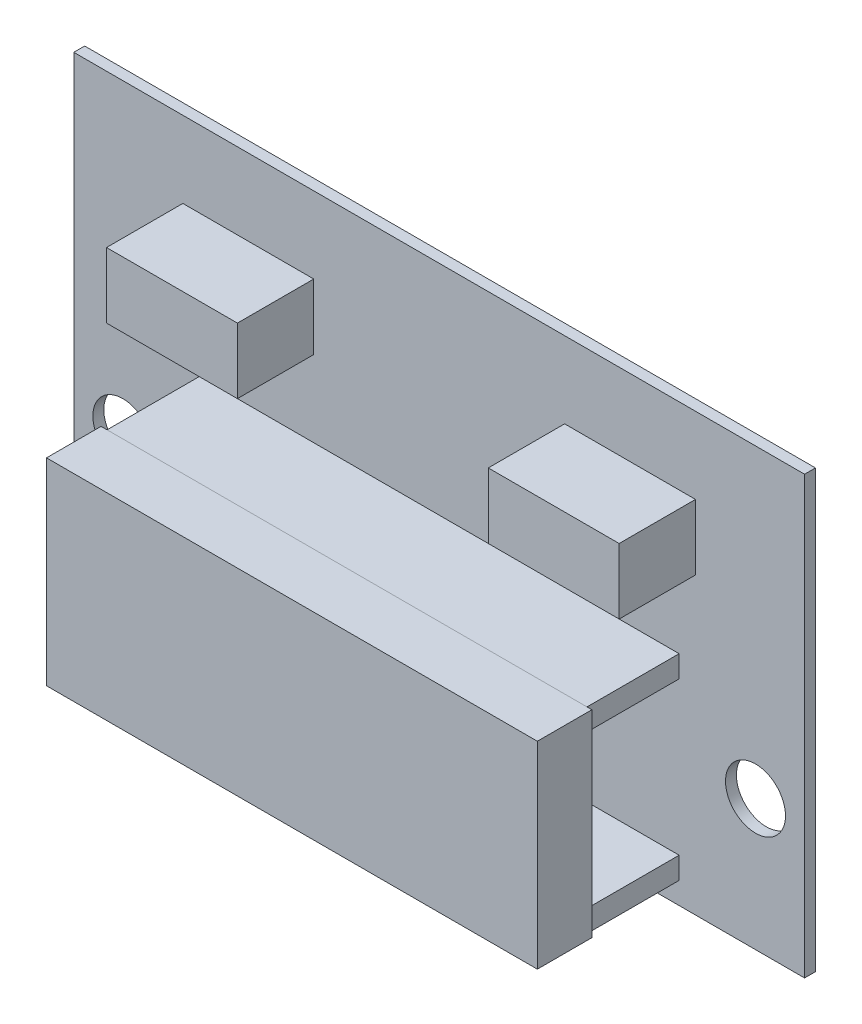
ISO-10303-21;
HEADER;
FILE_DESCRIPTION(('STEP AP214'),'2;1');
FILE_NAME('part.step','',(''),(''),'','','');
FILE_SCHEMA(('AUTOMOTIVE_DESIGN { 1 0 10303 214 1 1 1 1 }'));
ENDSEC;
DATA;
#1=APPLICATION_CONTEXT('core data for automotive mechanical design processes');
#2=APPLICATION_PROTOCOL_DEFINITION('international standard','automotive_design',2000,#1);
#3=PRODUCT_CONTEXT('',#1,'mechanical');
#4=PRODUCT('Part','Part','',(#3));
#5=PRODUCT_RELATED_PRODUCT_CATEGORY('part','',(#4));
#6=PRODUCT_DEFINITION_FORMATION('','',#4);
#7=PRODUCT_DEFINITION_CONTEXT('part definition',#1,'design');
#8=PRODUCT_DEFINITION('design','',#6,#7);
#9=PRODUCT_DEFINITION_SHAPE('','',#8);
#10=(LENGTH_UNIT() NAMED_UNIT(*) SI_UNIT(.MILLI.,.METRE.));
#11=(NAMED_UNIT(*) PLANE_ANGLE_UNIT() SI_UNIT($,.RADIAN.));
#12=(NAMED_UNIT(*) SI_UNIT($,.STERADIAN.) SOLID_ANGLE_UNIT());
#13=UNCERTAINTY_MEASURE_WITH_UNIT(LENGTH_MEASURE(1.E-05),#10,'distance_accuracy_value','');
#14=(GEOMETRIC_REPRESENTATION_CONTEXT(3) GLOBAL_UNCERTAINTY_ASSIGNED_CONTEXT((#13)) GLOBAL_UNIT_ASSIGNED_CONTEXT((#10,
#11,#12)) REPRESENTATION_CONTEXT('',''));
#15=CARTESIAN_POINT('',(0.,0.,0.));
#16=DIRECTION('',(0.,0.,1.));
#17=DIRECTION('',(1.,0.,0.));
#18=AXIS2_PLACEMENT_3D('',#15,#16,#17);
#19=CARTESIAN_POINT('',(0.,0.,1.));
#20=DIRECTION('',(0.,0.,1.));
#21=DIRECTION('',(1.,0.,0.));
#22=AXIS2_PLACEMENT_3D('',#19,#20,#21);
#23=PLANE('',#22);
#24=CARTESIAN_POINT('',(-29.,-8.,1.));
#25=DIRECTION('',(0.,0.,1.));
#26=DIRECTION('',(1.,0.,0.));
#27=AXIS2_PLACEMENT_3D('',#24,#25,#26);
#28=CIRCLE('',#27,2.75);
#29=CARTESIAN_POINT('',(-26.25,-8.,1.));
#30=VERTEX_POINT('',#29);
#31=EDGE_CURVE('E260',#30,#30,#28,.T.);
#32=ORIENTED_EDGE('',*,*,#31,.F.);
#33=EDGE_LOOP('',(#32));
#34=FACE_BOUND('',#33,.T.);
#35=CARTESIAN_POINT('',(29.,-8.,1.));
#36=DIRECTION('',(0.,0.,1.));
#37=DIRECTION('',(1.,0.,0.));
#38=AXIS2_PLACEMENT_3D('',#35,#36,#37);
#39=CIRCLE('',#38,2.74999999999999);
#40=CARTESIAN_POINT('',(31.75,-8.,1.));
#41=VERTEX_POINT('',#40);
#42=EDGE_CURVE('E259',#41,#41,#39,.T.);
#43=ORIENTED_EDGE('',*,*,#42,.F.);
#44=EDGE_LOOP('',(#43));
#45=FACE_BOUND('',#44,.T.);
#46=DIRECTION('',(0.,1.,0.));
#47=VECTOR('',#46,1.);
#48=CARTESIAN_POINT('',(33.5,20.,1.));
#49=LINE('',#48,#47);
#50=CARTESIAN_POINT('',(33.5,-20.,1.));
#51=VERTEX_POINT('',#50);
#52=CARTESIAN_POINT('',(33.5,20.,1.));
#53=VERTEX_POINT('',#52);
#54=EDGE_CURVE('E361',#51,#53,#49,.T.);
#55=ORIENTED_EDGE('',*,*,#54,.T.);
#56=DIRECTION('',(-1.,0.,0.));
#57=VECTOR('',#56,1.);
#58=CARTESIAN_POINT('',(-33.5,20.,1.));
#59=LINE('',#58,#57);
#60=CARTESIAN_POINT('',(-33.5,20.,1.));
#61=VERTEX_POINT('',#60);
#62=EDGE_CURVE('E364',#53,#61,#59,.T.);
#63=ORIENTED_EDGE('',*,*,#62,.T.);
#64=DIRECTION('',(0.,-1.,0.));
#65=VECTOR('',#64,1.);
#66=CARTESIAN_POINT('',(-33.5,20.,1.));
#67=LINE('',#66,#65);
#68=CARTESIAN_POINT('',(-33.5,-20.,1.));
#69=VERTEX_POINT('',#68);
#70=EDGE_CURVE('E367',#61,#69,#67,.T.);
#71=ORIENTED_EDGE('',*,*,#70,.T.);
#72=DIRECTION('',(1.,0.,0.));
#73=VECTOR('',#72,1.);
#74=CARTESIAN_POINT('',(-33.5,-20.,1.));
#75=LINE('',#74,#73);
#76=EDGE_CURVE('E369',#69,#51,#75,.T.);
#77=ORIENTED_EDGE('',*,*,#76,.T.);
#78=EDGE_LOOP('',(#55,#63,#71,#77));
#79=FACE_BOUND('',#78,.T.);
#80=DIRECTION('',(-1.,0.,0.));
#81=VECTOR('',#80,1.);
#82=CARTESIAN_POINT('',(-22.,0.,1.));
#83=LINE('',#82,#81);
#84=CARTESIAN_POINT('',(22.,0.,1.));
#85=VERTEX_POINT('',#84);
#86=CARTESIAN_POINT('',(-22.,0.,1.));
#87=VERTEX_POINT('',#86);
#88=EDGE_CURVE('E345',#85,#87,#83,.T.);
#89=ORIENTED_EDGE('',*,*,#88,.F.);
#90=DIRECTION('',(0.,1.,0.));
#91=VECTOR('',#90,1.);
#92=CARTESIAN_POINT('',(22.,0.,1.));
#93=LINE('',#92,#91);
#94=CARTESIAN_POINT('',(22.,-2.,1.));
#95=VERTEX_POINT('',#94);
#96=EDGE_CURVE('E328',#95,#85,#93,.T.);
#97=ORIENTED_EDGE('',*,*,#96,.F.);
#98=DIRECTION('',(1.,0.,0.));
#99=VECTOR('',#98,1.);
#100=CARTESIAN_POINT('',(-22.,-2.,1.));
#101=LINE('',#100,#99);
#102=CARTESIAN_POINT('',(-22.,-2.,1.));
#103=VERTEX_POINT('',#102);
#104=EDGE_CURVE('E333',#103,#95,#101,.T.);
#105=ORIENTED_EDGE('',*,*,#104,.F.);
#106=DIRECTION('',(0.,-1.,0.));
#107=VECTOR('',#106,1.);
#108=CARTESIAN_POINT('',(-22.,0.,1.));
#109=LINE('',#108,#107);
#110=EDGE_CURVE('E347',#87,#103,#109,.T.);
#111=ORIENTED_EDGE('',*,*,#110,.F.);
#112=EDGE_LOOP('',(#89,#97,#105,#111));
#113=FACE_BOUND('',#112,.T.);
#114=DIRECTION('',(-1.,0.,0.));
#115=VECTOR('',#114,1.);
#116=CARTESIAN_POINT('',(-22.,-16.,1.));
#117=LINE('',#116,#115);
#118=CARTESIAN_POINT('',(22.,-16.,1.));
#119=VERTEX_POINT('',#118);
#120=CARTESIAN_POINT('',(-22.,-16.,1.));
#121=VERTEX_POINT('',#120);
#122=EDGE_CURVE('E313',#119,#121,#117,.T.);
#123=ORIENTED_EDGE('',*,*,#122,.F.);
#124=DIRECTION('',(0.,1.,0.));
#125=VECTOR('',#124,1.);
#126=CARTESIAN_POINT('',(22.,-16.,1.));
#127=LINE('',#126,#125);
#128=CARTESIAN_POINT('',(22.,-18.,1.));
#129=VERTEX_POINT('',#128);
#130=EDGE_CURVE('E296',#129,#119,#127,.T.);
#131=ORIENTED_EDGE('',*,*,#130,.F.);
#132=DIRECTION('',(1.,0.,0.));
#133=VECTOR('',#132,1.);
#134=CARTESIAN_POINT('',(-22.,-18.,1.));
#135=LINE('',#134,#133);
#136=CARTESIAN_POINT('',(-22.,-18.,1.));
#137=VERTEX_POINT('',#136);
#138=EDGE_CURVE('E301',#137,#129,#135,.T.);
#139=ORIENTED_EDGE('',*,*,#138,.F.);
#140=DIRECTION('',(0.,-1.,0.));
#141=VECTOR('',#140,1.);
#142=CARTESIAN_POINT('',(-22.,-16.,1.));
#143=LINE('',#142,#141);
#144=EDGE_CURVE('E315',#121,#137,#143,.T.);
#145=ORIENTED_EDGE('',*,*,#144,.F.);
#146=EDGE_LOOP('',(#123,#131,#139,#145));
#147=FACE_BOUND('',#146,.T.);
#148=DIRECTION('',(-1.,0.,0.));
#149=VECTOR('',#148,1.);
#150=CARTESIAN_POINT('',(-23.5,13.,1.));
#151=LINE('',#150,#149);
#152=CARTESIAN_POINT('',(-11.5,13.,1.));
#153=VERTEX_POINT('',#152);
#154=CARTESIAN_POINT('',(-23.5,13.,1.));
#155=VERTEX_POINT('',#154);
#156=EDGE_CURVE('E231',#153,#155,#151,.T.);
#157=ORIENTED_EDGE('',*,*,#156,.F.);
#158=DIRECTION('',(0.,1.,0.));
#159=VECTOR('',#158,1.);
#160=CARTESIAN_POINT('',(-11.5,13.,1.));
#161=LINE('',#160,#159);
#162=CARTESIAN_POINT('',(-11.5,7.,1.));
#163=VERTEX_POINT('',#162);
#164=EDGE_CURVE('E228',#163,#153,#161,.T.);
#165=ORIENTED_EDGE('',*,*,#164,.F.);
#166=DIRECTION('',(1.,0.,0.));
#167=VECTOR('',#166,1.);
#168=CARTESIAN_POINT('',(-23.5,7.,1.));
#169=LINE('',#168,#167);
#170=CARTESIAN_POINT('',(-23.5,7.,1.));
#171=VERTEX_POINT('',#170);
#172=EDGE_CURVE('E240',#171,#163,#169,.T.);
#173=ORIENTED_EDGE('',*,*,#172,.F.);
#174=DIRECTION('',(0.,-1.,0.));
#175=VECTOR('',#174,1.);
#176=CARTESIAN_POINT('',(-23.5,13.,1.));
#177=LINE('',#176,#175);
#178=EDGE_CURVE('E248',#155,#171,#177,.T.);
#179=ORIENTED_EDGE('',*,*,#178,.F.);
#180=EDGE_LOOP('',(#157,#165,#173,#179));
#181=FACE_BOUND('',#180,.T.);
#182=DIRECTION('',(-1.,0.,0.));
#183=VECTOR('',#182,1.);
#184=CARTESIAN_POINT('',(23.5,13.,1.));
#185=LINE('',#184,#183);
#186=CARTESIAN_POINT('',(23.5,13.,1.));
#187=VERTEX_POINT('',#186);
#188=CARTESIAN_POINT('',(11.5,13.,1.));
#189=VERTEX_POINT('',#188);
#190=EDGE_CURVE('E462',#187,#189,#185,.T.);
#191=ORIENTED_EDGE('',*,*,#190,.F.);
#192=DIRECTION('',(0.,1.,0.));
#193=VECTOR('',#192,1.);
#194=CARTESIAN_POINT('',(23.5,13.,1.));
#195=LINE('',#194,#193);
#196=CARTESIAN_POINT('',(23.5,7.,1.));
#197=VERTEX_POINT('',#196);
#198=EDGE_CURVE('E226',#197,#187,#195,.T.);
#199=ORIENTED_EDGE('',*,*,#198,.F.);
#200=DIRECTION('',(1.,0.,0.));
#201=VECTOR('',#200,1.);
#202=CARTESIAN_POINT('',(23.5,7.,1.));
#203=LINE('',#202,#201);
#204=CARTESIAN_POINT('',(11.5,7.,1.));
#205=VERTEX_POINT('',#204);
#206=EDGE_CURVE('E222',#205,#197,#203,.T.);
#207=ORIENTED_EDGE('',*,*,#206,.F.);
#208=DIRECTION('',(0.,-1.,0.));
#209=VECTOR('',#208,1.);
#210=CARTESIAN_POINT('',(11.5,13.,1.));
#211=LINE('',#210,#209);
#212=EDGE_CURVE('E464',#189,#205,#211,.T.);
#213=ORIENTED_EDGE('',*,*,#212,.F.);
#214=EDGE_LOOP('',(#191,#199,#207,#213));
#215=FACE_BOUND('',#214,.T.);
#216=ADVANCED_FACE('F39',(#34,#45,#79,#113,#147,#181,#215),#23,.T.);
#217=CARTESIAN_POINT('',(33.5,20.,1.));
#218=DIRECTION('',(-1.,0.,0.));
#219=DIRECTION('',(0.,0.,1.));
#220=AXIS2_PLACEMENT_3D('',#217,#218,#219);
#221=PLANE('',#220);
#222=DIRECTION('',(0.,1.,0.));
#223=VECTOR('',#222,1.);
#224=CARTESIAN_POINT('',(33.5,20.,0.));
#225=LINE('',#224,#223);
#226=CARTESIAN_POINT('',(33.5,-20.,0.));
#227=VERTEX_POINT('',#226);
#228=CARTESIAN_POINT('',(33.5,20.,0.));
#229=VERTEX_POINT('',#228);
#230=EDGE_CURVE('E360',#227,#229,#225,.T.);
#231=ORIENTED_EDGE('',*,*,#230,.T.);
#232=DIRECTION('',(0.,0.,-1.));
#233=VECTOR('',#232,1.);
#234=CARTESIAN_POINT('',(33.5,20.,1.));
#235=LINE('',#234,#233);
#236=EDGE_CURVE('E11',#53,#229,#235,.T.);
#237=ORIENTED_EDGE('',*,*,#236,.F.);
#238=ORIENTED_EDGE('',*,*,#54,.F.);
#239=DIRECTION('',(0.,0.,-1.));
#240=VECTOR('',#239,1.);
#241=CARTESIAN_POINT('',(33.5,-20.,1.));
#242=LINE('',#241,#240);
#243=EDGE_CURVE('E371',#51,#227,#242,.T.);
#244=ORIENTED_EDGE('',*,*,#243,.T.);
#245=EDGE_LOOP('',(#231,#237,#238,#244));
#246=FACE_BOUND('',#245,.T.);
#247=ADVANCED_FACE('F41',(#246),#221,.F.);
#248=CARTESIAN_POINT('',(-33.5,20.,1.));
#249=DIRECTION('',(0.,-1.,0.));
#250=DIRECTION('',(0.,0.,-1.));
#251=AXIS2_PLACEMENT_3D('',#248,#249,#250);
#252=PLANE('',#251);
#253=DIRECTION('',(-1.,0.,0.));
#254=VECTOR('',#253,1.);
#255=CARTESIAN_POINT('',(-33.5,20.,0.));
#256=LINE('',#255,#254);
#257=CARTESIAN_POINT('',(-33.5,20.,0.));
#258=VERTEX_POINT('',#257);
#259=EDGE_CURVE('E374',#229,#258,#256,.T.);
#260=ORIENTED_EDGE('',*,*,#259,.T.);
#261=DIRECTION('',(0.,0.,-1.));
#262=VECTOR('',#261,1.);
#263=CARTESIAN_POINT('',(-33.5,20.,1.));
#264=LINE('',#263,#262);
#265=EDGE_CURVE('E48',#61,#258,#264,.T.);
#266=ORIENTED_EDGE('',*,*,#265,.F.);
#267=ORIENTED_EDGE('',*,*,#62,.F.);
#268=ORIENTED_EDGE('',*,*,#236,.T.);
#269=EDGE_LOOP('',(#260,#266,#267,#268));
#270=FACE_BOUND('',#269,.T.);
#271=ADVANCED_FACE('F415',(#270),#252,.F.);
#272=CARTESIAN_POINT('',(-33.5,20.,1.));
#273=DIRECTION('',(1.,0.,0.));
#274=DIRECTION('',(0.,0.,-1.));
#275=AXIS2_PLACEMENT_3D('',#272,#273,#274);
#276=PLANE('',#275);
#277=DIRECTION('',(0.,-1.,0.));
#278=VECTOR('',#277,1.);
#279=CARTESIAN_POINT('',(-33.5,20.,0.));
#280=LINE('',#279,#278);
#281=CARTESIAN_POINT('',(-33.5,-20.,0.));
#282=VERTEX_POINT('',#281);
#283=EDGE_CURVE('E376',#258,#282,#280,.T.);
#284=ORIENTED_EDGE('',*,*,#283,.T.);
#285=DIRECTION('',(0.,0.,-1.));
#286=VECTOR('',#285,1.);
#287=CARTESIAN_POINT('',(-33.5,-20.,1.));
#288=LINE('',#287,#286);
#289=EDGE_CURVE('E381',#69,#282,#288,.T.);
#290=ORIENTED_EDGE('',*,*,#289,.F.);
#291=ORIENTED_EDGE('',*,*,#70,.F.);
#292=ORIENTED_EDGE('',*,*,#265,.T.);
#293=EDGE_LOOP('',(#284,#290,#291,#292));
#294=FACE_BOUND('',#293,.T.);
#295=ADVANCED_FACE('F428',(#294),#276,.F.);
#296=CARTESIAN_POINT('',(-33.5,-20.,1.));
#297=DIRECTION('',(0.,1.,0.));
#298=DIRECTION('',(0.,0.,1.));
#299=AXIS2_PLACEMENT_3D('',#296,#297,#298);
#300=PLANE('',#299);
#301=DIRECTION('',(1.,0.,0.));
#302=VECTOR('',#301,1.);
#303=CARTESIAN_POINT('',(-33.5,-20.,0.));
#304=LINE('',#303,#302);
#305=EDGE_CURVE('E365',#282,#227,#304,.T.);
#306=ORIENTED_EDGE('',*,*,#305,.T.);
#307=ORIENTED_EDGE('',*,*,#243,.F.);
#308=ORIENTED_EDGE('',*,*,#76,.F.);
#309=ORIENTED_EDGE('',*,*,#289,.T.);
#310=EDGE_LOOP('',(#306,#307,#308,#309));
#311=FACE_BOUND('',#310,.T.);
#312=ADVANCED_FACE('F425',(#311),#300,.F.);
#313=CARTESIAN_POINT('',(0.,0.,0.));
#314=DIRECTION('',(0.,0.,1.));
#315=DIRECTION('',(1.,0.,0.));
#316=AXIS2_PLACEMENT_3D('',#313,#314,#315);
#317=PLANE('',#316);
#318=CARTESIAN_POINT('',(-29.,-8.,0.));
#319=DIRECTION('',(0.,0.,1.));
#320=DIRECTION('',(1.,0.,0.));
#321=AXIS2_PLACEMENT_3D('',#318,#319,#320);
#322=CIRCLE('',#321,2.75);
#323=CARTESIAN_POINT('',(-26.25,-8.,0.));
#324=VERTEX_POINT('',#323);
#325=EDGE_CURVE('E43',#324,#324,#322,.T.);
#326=ORIENTED_EDGE('',*,*,#325,.T.);
#327=EDGE_LOOP('',(#326));
#328=FACE_BOUND('',#327,.T.);
#329=CARTESIAN_POINT('',(29.,-8.,0.));
#330=DIRECTION('',(0.,0.,1.));
#331=DIRECTION('',(1.,0.,0.));
#332=AXIS2_PLACEMENT_3D('',#329,#330,#331);
#333=CIRCLE('',#332,2.74999999999999);
#334=CARTESIAN_POINT('',(31.75,-8.,0.));
#335=VERTEX_POINT('',#334);
#336=EDGE_CURVE('E263',#335,#335,#333,.T.);
#337=ORIENTED_EDGE('',*,*,#336,.T.);
#338=EDGE_LOOP('',(#337));
#339=FACE_BOUND('',#338,.T.);
#340=ORIENTED_EDGE('',*,*,#230,.F.);
#341=ORIENTED_EDGE('',*,*,#305,.F.);
#342=ORIENTED_EDGE('',*,*,#283,.F.);
#343=ORIENTED_EDGE('',*,*,#259,.F.);
#344=EDGE_LOOP('',(#340,#341,#342,#343));
#345=FACE_BOUND('',#344,.T.);
#346=ADVANCED_FACE('F391',(#328,#339,#345),#317,.F.);
#347=CARTESIAN_POINT('',(22.,0.,9.5));
#348=DIRECTION('',(-1.,0.,0.));
#349=DIRECTION('',(0.,0.,1.));
#350=AXIS2_PLACEMENT_3D('',#347,#348,#349);
#351=PLANE('',#350);
#352=ORIENTED_EDGE('',*,*,#96,.T.);
#353=DIRECTION('',(0.,0.,-1.));
#354=VECTOR('',#353,1.);
#355=CARTESIAN_POINT('',(22.,0.,9.5));
#356=LINE('',#355,#354);
#357=CARTESIAN_POINT('',(22.,0.,9.5));
#358=VERTEX_POINT('',#357);
#359=EDGE_CURVE('E358',#358,#85,#356,.T.);
#360=ORIENTED_EDGE('',*,*,#359,.F.);
#361=DIRECTION('',(0.,1.,0.));
#362=VECTOR('',#361,1.);
#363=CARTESIAN_POINT('',(22.,0.,9.5));
#364=LINE('',#363,#362);
#365=CARTESIAN_POINT('',(22.,-2.,9.5));
#366=VERTEX_POINT('',#365);
#367=EDGE_CURVE('E329',#366,#358,#364,.T.);
#368=ORIENTED_EDGE('',*,*,#367,.F.);
#369=DIRECTION('',(0.,0.,-1.));
#370=VECTOR('',#369,1.);
#371=CARTESIAN_POINT('',(22.,-2.,9.5));
#372=LINE('',#371,#370);
#373=EDGE_CURVE('E342',#366,#95,#372,.T.);
#374=ORIENTED_EDGE('',*,*,#373,.T.);
#375=EDGE_LOOP('',(#352,#360,#368,#374));
#376=FACE_BOUND('',#375,.T.);
#377=ADVANCED_FACE('F421',(#376),#351,.F.);
#378=CARTESIAN_POINT('',(-22.,0.,9.5));
#379=DIRECTION('',(0.,-1.,0.));
#380=DIRECTION('',(0.,0.,-1.));
#381=AXIS2_PLACEMENT_3D('',#378,#379,#380);
#382=PLANE('',#381);
#383=ORIENTED_EDGE('',*,*,#88,.T.);
#384=DIRECTION('',(0.,0.,-1.));
#385=VECTOR('',#384,1.);
#386=CARTESIAN_POINT('',(-22.,0.,9.5));
#387=LINE('',#386,#385);
#388=CARTESIAN_POINT('',(-22.,0.,9.5));
#389=VERTEX_POINT('',#388);
#390=EDGE_CURVE('E355',#389,#87,#387,.T.);
#391=ORIENTED_EDGE('',*,*,#390,.F.);
#392=DIRECTION('',(-1.,0.,0.));
#393=VECTOR('',#392,1.);
#394=CARTESIAN_POINT('',(-22.,0.,9.5));
#395=LINE('',#394,#393);
#396=EDGE_CURVE('E332',#358,#389,#395,.T.);
#397=ORIENTED_EDGE('',*,*,#396,.F.);
#398=ORIENTED_EDGE('',*,*,#359,.T.);
#399=EDGE_LOOP('',(#383,#391,#397,#398));
#400=FACE_BOUND('',#399,.T.);
#401=ADVANCED_FACE('F687',(#400),#382,.F.);
#402=CARTESIAN_POINT('',(-22.,0.,9.5));
#403=DIRECTION('',(1.,0.,0.));
#404=DIRECTION('',(0.,0.,-1.));
#405=AXIS2_PLACEMENT_3D('',#402,#403,#404);
#406=PLANE('',#405);
#407=ORIENTED_EDGE('',*,*,#110,.T.);
#408=DIRECTION('',(0.,0.,-1.));
#409=VECTOR('',#408,1.);
#410=CARTESIAN_POINT('',(-22.,-2.,9.5));
#411=LINE('',#410,#409);
#412=CARTESIAN_POINT('',(-22.,-2.,9.5));
#413=VERTEX_POINT('',#412);
#414=EDGE_CURVE('E353',#413,#103,#411,.T.);
#415=ORIENTED_EDGE('',*,*,#414,.F.);
#416=DIRECTION('',(0.,-1.,0.));
#417=VECTOR('',#416,1.);
#418=CARTESIAN_POINT('',(-22.,0.,9.5));
#419=LINE('',#418,#417);
#420=EDGE_CURVE('E336',#389,#413,#419,.T.);
#421=ORIENTED_EDGE('',*,*,#420,.F.);
#422=ORIENTED_EDGE('',*,*,#390,.T.);
#423=EDGE_LOOP('',(#407,#415,#421,#422));
#424=FACE_BOUND('',#423,.T.);
#425=ADVANCED_FACE('F678',(#424),#406,.F.);
#426=CARTESIAN_POINT('',(-22.,-2.,9.5));
#427=DIRECTION('',(0.,1.,0.));
#428=DIRECTION('',(0.,0.,1.));
#429=AXIS2_PLACEMENT_3D('',#426,#427,#428);
#430=PLANE('',#429);
#431=ORIENTED_EDGE('',*,*,#104,.T.);
#432=ORIENTED_EDGE('',*,*,#373,.F.);
#433=DIRECTION('',(1.,0.,0.));
#434=VECTOR('',#433,1.);
#435=CARTESIAN_POINT('',(-22.,-2.,9.5));
#436=LINE('',#435,#434);
#437=EDGE_CURVE('E339',#413,#366,#436,.T.);
#438=ORIENTED_EDGE('',*,*,#437,.F.);
#439=ORIENTED_EDGE('',*,*,#414,.T.);
#440=EDGE_LOOP('',(#431,#432,#438,#439));
#441=FACE_BOUND('',#440,.T.);
#442=ADVANCED_FACE('F669',(#441),#430,.F.);
#443=CARTESIAN_POINT('',(22.,-16.,9.5));
#444=DIRECTION('',(-1.,0.,0.));
#445=DIRECTION('',(0.,-1.,0.));
#446=AXIS2_PLACEMENT_3D('',#443,#444,#445);
#447=PLANE('',#446);
#448=ORIENTED_EDGE('',*,*,#130,.T.);
#449=DIRECTION('',(0.,0.,-1.));
#450=VECTOR('',#449,1.);
#451=CARTESIAN_POINT('',(22.,-16.,9.5));
#452=LINE('',#451,#450);
#453=CARTESIAN_POINT('',(22.,-16.,9.5));
#454=VERTEX_POINT('',#453);
#455=EDGE_CURVE('E326',#454,#119,#452,.T.);
#456=ORIENTED_EDGE('',*,*,#455,.F.);
#457=DIRECTION('',(0.,1.,0.));
#458=VECTOR('',#457,1.);
#459=CARTESIAN_POINT('',(22.,-16.,9.5));
#460=LINE('',#459,#458);
#461=CARTESIAN_POINT('',(22.,-18.,9.5));
#462=VERTEX_POINT('',#461);
#463=EDGE_CURVE('E297',#462,#454,#460,.T.);
#464=ORIENTED_EDGE('',*,*,#463,.F.);
#465=DIRECTION('',(0.,0.,-1.));
#466=VECTOR('',#465,1.);
#467=CARTESIAN_POINT('',(22.,-18.,9.5));
#468=LINE('',#467,#466);
#469=EDGE_CURVE('E310',#462,#129,#468,.T.);
#470=ORIENTED_EDGE('',*,*,#469,.T.);
#471=EDGE_LOOP('',(#448,#456,#464,#470));
#472=FACE_BOUND('',#471,.T.);
#473=ADVANCED_FACE('F660',(#472),#447,.F.);
#474=CARTESIAN_POINT('',(-22.,-16.,9.5));
#475=DIRECTION('',(0.,-1.,0.));
#476=DIRECTION('',(0.,0.,-1.));
#477=AXIS2_PLACEMENT_3D('',#474,#475,#476);
#478=PLANE('',#477);
#479=ORIENTED_EDGE('',*,*,#122,.T.);
#480=DIRECTION('',(0.,0.,-1.));
#481=VECTOR('',#480,1.);
#482=CARTESIAN_POINT('',(-22.,-16.,9.5));
#483=LINE('',#482,#481);
#484=CARTESIAN_POINT('',(-22.,-16.,9.5));
#485=VERTEX_POINT('',#484);
#486=EDGE_CURVE('E323',#485,#121,#483,.T.);
#487=ORIENTED_EDGE('',*,*,#486,.F.);
#488=DIRECTION('',(-1.,0.,0.));
#489=VECTOR('',#488,1.);
#490=CARTESIAN_POINT('',(-22.,-16.,9.5));
#491=LINE('',#490,#489);
#492=EDGE_CURVE('E300',#454,#485,#491,.T.);
#493=ORIENTED_EDGE('',*,*,#492,.F.);
#494=ORIENTED_EDGE('',*,*,#455,.T.);
#495=EDGE_LOOP('',(#479,#487,#493,#494));
#496=FACE_BOUND('',#495,.T.);
#497=ADVANCED_FACE('F651',(#496),#478,.F.);
#498=CARTESIAN_POINT('',(-22.,-16.,9.5));
#499=DIRECTION('',(1.,0.,0.));
#500=DIRECTION('',(0.,0.,-1.));
#501=AXIS2_PLACEMENT_3D('',#498,#499,#500);
#502=PLANE('',#501);
#503=ORIENTED_EDGE('',*,*,#144,.T.);
#504=DIRECTION('',(0.,0.,-1.));
#505=VECTOR('',#504,1.);
#506=CARTESIAN_POINT('',(-22.,-18.,9.5));
#507=LINE('',#506,#505);
#508=CARTESIAN_POINT('',(-22.,-18.,9.5));
#509=VERTEX_POINT('',#508);
#510=EDGE_CURVE('E321',#509,#137,#507,.T.);
#511=ORIENTED_EDGE('',*,*,#510,.F.);
#512=DIRECTION('',(0.,-1.,0.));
#513=VECTOR('',#512,1.);
#514=CARTESIAN_POINT('',(-22.,-16.,9.5));
#515=LINE('',#514,#513);
#516=EDGE_CURVE('E304',#485,#509,#515,.T.);
#517=ORIENTED_EDGE('',*,*,#516,.F.);
#518=ORIENTED_EDGE('',*,*,#486,.T.);
#519=EDGE_LOOP('',(#503,#511,#517,#518));
#520=FACE_BOUND('',#519,.T.);
#521=ADVANCED_FACE('F642',(#520),#502,.F.);
#522=CARTESIAN_POINT('',(-22.,-18.,9.5));
#523=DIRECTION('',(0.,1.,0.));
#524=DIRECTION('',(0.,0.,1.));
#525=AXIS2_PLACEMENT_3D('',#522,#523,#524);
#526=PLANE('',#525);
#527=ORIENTED_EDGE('',*,*,#138,.T.);
#528=ORIENTED_EDGE('',*,*,#469,.F.);
#529=DIRECTION('',(1.,0.,0.));
#530=VECTOR('',#529,1.);
#531=CARTESIAN_POINT('',(-22.,-18.,9.5));
#532=LINE('',#531,#530);
#533=EDGE_CURVE('E307',#509,#462,#532,.T.);
#534=ORIENTED_EDGE('',*,*,#533,.F.);
#535=ORIENTED_EDGE('',*,*,#510,.T.);
#536=EDGE_LOOP('',(#527,#528,#534,#535));
#537=FACE_BOUND('',#536,.T.);
#538=ADVANCED_FACE('F633',(#537),#526,.F.);
#539=CARTESIAN_POINT('',(0.,0.,9.5));
#540=DIRECTION('',(0.,0.,1.));
#541=DIRECTION('',(1.,0.,0.));
#542=AXIS2_PLACEMENT_3D('',#539,#540,#541);
#543=PLANE('',#542);
#544=DIRECTION('',(0.,1.,0.));
#545=VECTOR('',#544,1.);
#546=CARTESIAN_POINT('',(22.5,0.049999999999998,9.5));
#547=LINE('',#546,#545);
#548=CARTESIAN_POINT('',(22.5,-18.05,9.5));
#549=VERTEX_POINT('',#548);
#550=CARTESIAN_POINT('',(22.5,0.049999999999998,9.5));
#551=VERTEX_POINT('',#550);
#552=EDGE_CURVE('E277',#549,#551,#547,.T.);
#553=ORIENTED_EDGE('',*,*,#552,.F.);
#554=DIRECTION('',(1.,0.,0.));
#555=VECTOR('',#554,1.);
#556=CARTESIAN_POINT('',(-22.5,-18.05,9.5));
#557=LINE('',#556,#555);
#558=CARTESIAN_POINT('',(-22.5,-18.05,9.5));
#559=VERTEX_POINT('',#558);
#560=EDGE_CURVE('E270',#559,#549,#557,.T.);
#561=ORIENTED_EDGE('',*,*,#560,.F.);
#562=DIRECTION('',(0.,-1.,0.));
#563=VECTOR('',#562,1.);
#564=CARTESIAN_POINT('',(-22.5,0.0500000000000066,9.5));
#565=LINE('',#564,#563);
#566=CARTESIAN_POINT('',(-22.5,0.0500000000000066,9.5));
#567=VERTEX_POINT('',#566);
#568=EDGE_CURVE('E282',#567,#559,#565,.T.);
#569=ORIENTED_EDGE('',*,*,#568,.F.);
#570=DIRECTION('',(-1.,0.,0.));
#571=VECTOR('',#570,1.);
#572=CARTESIAN_POINT('',(-22.5,0.0500000000000066,9.5));
#573=LINE('',#572,#571);
#574=EDGE_CURVE('E280',#551,#567,#573,.T.);
#575=ORIENTED_EDGE('',*,*,#574,.F.);
#576=EDGE_LOOP('',(#553,#561,#569,#575));
#577=FACE_BOUND('',#576,.T.);
#578=ORIENTED_EDGE('',*,*,#533,.T.);
#579=ORIENTED_EDGE('',*,*,#463,.T.);
#580=ORIENTED_EDGE('',*,*,#492,.T.);
#581=ORIENTED_EDGE('',*,*,#516,.T.);
#582=EDGE_LOOP('',(#578,#579,#580,#581));
#583=FACE_BOUND('',#582,.T.);
#584=ORIENTED_EDGE('',*,*,#437,.T.);
#585=ORIENTED_EDGE('',*,*,#367,.T.);
#586=ORIENTED_EDGE('',*,*,#396,.T.);
#587=ORIENTED_EDGE('',*,*,#420,.T.);
#588=EDGE_LOOP('',(#584,#585,#586,#587));
#589=FACE_BOUND('',#588,.T.);
#590=ADVANCED_FACE('F624',(#577,#583,#589),#543,.F.);
#591=CARTESIAN_POINT('',(22.5,0.049999999999998,14.5));
#592=DIRECTION('',(-1.,0.,0.));
#593=DIRECTION('',(0.,-1.,0.));
#594=AXIS2_PLACEMENT_3D('',#591,#592,#593);
#595=PLANE('',#594);
#596=ORIENTED_EDGE('',*,*,#552,.T.);
#597=DIRECTION('',(0.,0.,-1.));
#598=VECTOR('',#597,1.);
#599=CARTESIAN_POINT('',(22.5,0.049999999999998,14.5));
#600=LINE('',#599,#598);
#601=CARTESIAN_POINT('',(22.5,0.049999999999998,14.5));
#602=VERTEX_POINT('',#601);
#603=EDGE_CURVE('E293',#602,#551,#600,.T.);
#604=ORIENTED_EDGE('',*,*,#603,.F.);
#605=DIRECTION('',(0.,1.,0.));
#606=VECTOR('',#605,1.);
#607=CARTESIAN_POINT('',(22.5,0.049999999999998,14.5));
#608=LINE('',#607,#606);
#609=CARTESIAN_POINT('',(22.5,-18.05,14.5));
#610=VERTEX_POINT('',#609);
#611=EDGE_CURVE('E266',#610,#602,#608,.T.);
#612=ORIENTED_EDGE('',*,*,#611,.F.);
#613=DIRECTION('',(0.,0.,-1.));
#614=VECTOR('',#613,1.);
#615=CARTESIAN_POINT('',(22.5,-18.05,14.5));
#616=LINE('',#615,#614);
#617=EDGE_CURVE('E276',#610,#549,#616,.T.);
#618=ORIENTED_EDGE('',*,*,#617,.T.);
#619=EDGE_LOOP('',(#596,#604,#612,#618));
#620=FACE_BOUND('',#619,.T.);
#621=ADVANCED_FACE('F615',(#620),#595,.F.);
#622=CARTESIAN_POINT('',(-22.5,0.0500000000000066,14.5));
#623=DIRECTION('',(0.,-1.,0.));
#624=DIRECTION('',(1.,0.,0.));
#625=AXIS2_PLACEMENT_3D('',#622,#623,#624);
#626=PLANE('',#625);
#627=ORIENTED_EDGE('',*,*,#574,.T.);
#628=DIRECTION('',(0.,0.,-1.));
#629=VECTOR('',#628,1.);
#630=CARTESIAN_POINT('',(-22.5,0.0500000000000066,14.5));
#631=LINE('',#630,#629);
#632=CARTESIAN_POINT('',(-22.5,0.0500000000000066,14.5));
#633=VERTEX_POINT('',#632);
#634=EDGE_CURVE('E290',#633,#567,#631,.T.);
#635=ORIENTED_EDGE('',*,*,#634,.F.);
#636=DIRECTION('',(-1.,0.,0.));
#637=VECTOR('',#636,1.);
#638=CARTESIAN_POINT('',(-22.5,0.0500000000000066,14.5));
#639=LINE('',#638,#637);
#640=EDGE_CURVE('E269',#602,#633,#639,.T.);
#641=ORIENTED_EDGE('',*,*,#640,.F.);
#642=ORIENTED_EDGE('',*,*,#603,.T.);
#643=EDGE_LOOP('',(#627,#635,#641,#642));
#644=FACE_BOUND('',#643,.T.);
#645=ADVANCED_FACE('F606',(#644),#626,.F.);
#646=CARTESIAN_POINT('',(-22.5,0.0500000000000066,14.5));
#647=DIRECTION('',(1.,0.,0.));
#648=DIRECTION('',(0.,1.,0.));
#649=AXIS2_PLACEMENT_3D('',#646,#647,#648);
#650=PLANE('',#649);
#651=ORIENTED_EDGE('',*,*,#568,.T.);
#652=DIRECTION('',(0.,0.,-1.));
#653=VECTOR('',#652,1.);
#654=CARTESIAN_POINT('',(-22.5,-18.05,14.5));
#655=LINE('',#654,#653);
#656=CARTESIAN_POINT('',(-22.5,-18.05,14.5));
#657=VERTEX_POINT('',#656);
#658=EDGE_CURVE('E287',#657,#559,#655,.T.);
#659=ORIENTED_EDGE('',*,*,#658,.F.);
#660=DIRECTION('',(0.,-1.,0.));
#661=VECTOR('',#660,1.);
#662=CARTESIAN_POINT('',(-22.5,0.0500000000000066,14.5));
#663=LINE('',#662,#661);
#664=EDGE_CURVE('E272',#633,#657,#663,.T.);
#665=ORIENTED_EDGE('',*,*,#664,.F.);
#666=ORIENTED_EDGE('',*,*,#634,.T.);
#667=EDGE_LOOP('',(#651,#659,#665,#666));
#668=FACE_BOUND('',#667,.T.);
#669=ADVANCED_FACE('F597',(#668),#650,.F.);
#670=CARTESIAN_POINT('',(-22.5,-18.05,14.5));
#671=DIRECTION('',(0.,1.,0.));
#672=DIRECTION('',(-1.,0.,0.));
#673=AXIS2_PLACEMENT_3D('',#670,#671,#672);
#674=PLANE('',#673);
#675=ORIENTED_EDGE('',*,*,#560,.T.);
#676=ORIENTED_EDGE('',*,*,#617,.F.);
#677=DIRECTION('',(1.,0.,0.));
#678=VECTOR('',#677,1.);
#679=CARTESIAN_POINT('',(-22.5,-18.05,14.5));
#680=LINE('',#679,#678);
#681=EDGE_CURVE('E274',#657,#610,#680,.T.);
#682=ORIENTED_EDGE('',*,*,#681,.F.);
#683=ORIENTED_EDGE('',*,*,#658,.T.);
#684=EDGE_LOOP('',(#675,#676,#682,#683));
#685=FACE_BOUND('',#684,.T.);
#686=ADVANCED_FACE('F588',(#685),#674,.F.);
#687=CARTESIAN_POINT('',(0.,0.,14.5));
#688=DIRECTION('',(0.,0.,1.));
#689=DIRECTION('',(1.,0.,0.));
#690=AXIS2_PLACEMENT_3D('',#687,#688,#689);
#691=PLANE('',#690);
#692=ORIENTED_EDGE('',*,*,#611,.T.);
#693=ORIENTED_EDGE('',*,*,#640,.T.);
#694=ORIENTED_EDGE('',*,*,#664,.T.);
#695=ORIENTED_EDGE('',*,*,#681,.T.);
#696=EDGE_LOOP('',(#692,#693,#694,#695));
#697=FACE_BOUND('',#696,.T.);
#698=ADVANCED_FACE('F406',(#697),#691,.T.);
#699=CARTESIAN_POINT('',(29.,-8.,-4.));
#700=DIRECTION('',(0.,0.,1.));
#701=DIRECTION('',(1.,0.,0.));
#702=AXIS2_PLACEMENT_3D('',#699,#700,#701);
#703=CYLINDRICAL_SURFACE('',#702,2.74999999999999);
#704=ORIENTED_EDGE('',*,*,#42,.T.);
#705=EDGE_LOOP('',(#704));
#706=FACE_BOUND('',#705,.T.);
#707=ORIENTED_EDGE('',*,*,#336,.F.);
#708=EDGE_LOOP('',(#707));
#709=FACE_BOUND('',#708,.T.);
#710=ADVANCED_FACE('F396',(#706,#709),#703,.F.);
#711=CARTESIAN_POINT('',(-29.,-8.,-4.));
#712=DIRECTION('',(0.,0.,1.));
#713=DIRECTION('',(1.,0.,0.));
#714=AXIS2_PLACEMENT_3D('',#711,#712,#713);
#715=CYLINDRICAL_SURFACE('',#714,2.75);
#716=ORIENTED_EDGE('',*,*,#31,.T.);
#717=EDGE_LOOP('',(#716));
#718=FACE_BOUND('',#717,.T.);
#719=ORIENTED_EDGE('',*,*,#325,.F.);
#720=EDGE_LOOP('',(#719));
#721=FACE_BOUND('',#720,.T.);
#722=ADVANCED_FACE('F393',(#718,#721),#715,.F.);
#723=CARTESIAN_POINT('',(-11.5,13.,8.));
#724=DIRECTION('',(-1.,0.,0.));
#725=DIRECTION('',(0.,0.,1.));
#726=AXIS2_PLACEMENT_3D('',#723,#724,#725);
#727=PLANE('',#726);
#728=ORIENTED_EDGE('',*,*,#164,.T.);
#729=DIRECTION('',(0.,0.,-1.));
#730=VECTOR('',#729,1.);
#731=CARTESIAN_POINT('',(-11.5,13.,8.));
#732=LINE('',#731,#730);
#733=CARTESIAN_POINT('',(-11.5,13.,8.));
#734=VERTEX_POINT('',#733);
#735=EDGE_CURVE('E257',#734,#153,#732,.T.);
#736=ORIENTED_EDGE('',*,*,#735,.F.);
#737=DIRECTION('',(0.,1.,0.));
#738=VECTOR('',#737,1.);
#739=CARTESIAN_POINT('',(-11.5,13.,8.));
#740=LINE('',#739,#738);
#741=CARTESIAN_POINT('',(-11.5,7.,8.));
#742=VERTEX_POINT('',#741);
#743=EDGE_CURVE('E236',#742,#734,#740,.T.);
#744=ORIENTED_EDGE('',*,*,#743,.F.);
#745=DIRECTION('',(0.,0.,-1.));
#746=VECTOR('',#745,1.);
#747=CARTESIAN_POINT('',(-11.5,7.,8.));
#748=LINE('',#747,#746);
#749=EDGE_CURVE('E245',#742,#163,#748,.T.);
#750=ORIENTED_EDGE('',*,*,#749,.T.);
#751=EDGE_LOOP('',(#728,#736,#744,#750));
#752=FACE_BOUND('',#751,.T.);
#753=ADVANCED_FACE('F395',(#752),#727,.F.);
#754=CARTESIAN_POINT('',(-23.5,13.,8.));
#755=DIRECTION('',(0.,-1.,0.));
#756=DIRECTION('',(1.,0.,0.));
#757=AXIS2_PLACEMENT_3D('',#754,#755,#756);
#758=PLANE('',#757);
#759=ORIENTED_EDGE('',*,*,#156,.T.);
#760=DIRECTION('',(0.,0.,-1.));
#761=VECTOR('',#760,1.);
#762=CARTESIAN_POINT('',(-23.5,13.,8.));
#763=LINE('',#762,#761);
#764=CARTESIAN_POINT('',(-23.5,13.,8.));
#765=VERTEX_POINT('',#764);
#766=EDGE_CURVE('E254',#765,#155,#763,.T.);
#767=ORIENTED_EDGE('',*,*,#766,.F.);
#768=DIRECTION('',(-1.,0.,0.));
#769=VECTOR('',#768,1.);
#770=CARTESIAN_POINT('',(-23.5,13.,8.));
#771=LINE('',#770,#769);
#772=EDGE_CURVE('E239',#734,#765,#771,.T.);
#773=ORIENTED_EDGE('',*,*,#772,.F.);
#774=ORIENTED_EDGE('',*,*,#735,.T.);
#775=EDGE_LOOP('',(#759,#767,#773,#774));
#776=FACE_BOUND('',#775,.T.);
#777=ADVANCED_FACE('F403',(#776),#758,.F.);
#778=CARTESIAN_POINT('',(-23.5,13.,8.));
#779=DIRECTION('',(1.,0.,0.));
#780=DIRECTION('',(0.,0.,-1.));
#781=AXIS2_PLACEMENT_3D('',#778,#779,#780);
#782=PLANE('',#781);
#783=ORIENTED_EDGE('',*,*,#178,.T.);
#784=DIRECTION('',(0.,0.,-1.));
#785=VECTOR('',#784,1.);
#786=CARTESIAN_POINT('',(-23.5,7.,8.));
#787=LINE('',#786,#785);
#788=CARTESIAN_POINT('',(-23.5,7.,8.));
#789=VERTEX_POINT('',#788);
#790=EDGE_CURVE('E64',#789,#171,#787,.T.);
#791=ORIENTED_EDGE('',*,*,#790,.F.);
#792=DIRECTION('',(0.,-1.,0.));
#793=VECTOR('',#792,1.);
#794=CARTESIAN_POINT('',(-23.5,13.,8.));
#795=LINE('',#794,#793);
#796=EDGE_CURVE('E242',#765,#789,#795,.T.);
#797=ORIENTED_EDGE('',*,*,#796,.F.);
#798=ORIENTED_EDGE('',*,*,#766,.T.);
#799=EDGE_LOOP('',(#783,#791,#797,#798));
#800=FACE_BOUND('',#799,.T.);
#801=ADVANCED_FACE('F496',(#800),#782,.F.);
#802=CARTESIAN_POINT('',(-23.5,7.,8.));
#803=DIRECTION('',(0.,1.,0.));
#804=DIRECTION('',(-1.,0.,0.));
#805=AXIS2_PLACEMENT_3D('',#802,#803,#804);
#806=PLANE('',#805);
#807=ORIENTED_EDGE('',*,*,#172,.T.);
#808=ORIENTED_EDGE('',*,*,#749,.F.);
#809=DIRECTION('',(1.,0.,0.));
#810=VECTOR('',#809,1.);
#811=CARTESIAN_POINT('',(-23.5,7.,8.));
#812=LINE('',#811,#810);
#813=EDGE_CURVE('E244',#789,#742,#812,.T.);
#814=ORIENTED_EDGE('',*,*,#813,.F.);
#815=ORIENTED_EDGE('',*,*,#790,.T.);
#816=EDGE_LOOP('',(#807,#808,#814,#815));
#817=FACE_BOUND('',#816,.T.);
#818=ADVANCED_FACE('F492',(#817),#806,.F.);
#819=CARTESIAN_POINT('',(0.,0.,8.));
#820=DIRECTION('',(0.,0.,1.));
#821=DIRECTION('',(1.,0.,0.));
#822=AXIS2_PLACEMENT_3D('',#819,#820,#821);
#823=PLANE('',#822);
#824=ORIENTED_EDGE('',*,*,#743,.T.);
#825=ORIENTED_EDGE('',*,*,#772,.T.);
#826=ORIENTED_EDGE('',*,*,#796,.T.);
#827=ORIENTED_EDGE('',*,*,#813,.T.);
#828=EDGE_LOOP('',(#824,#825,#826,#827));
#829=FACE_BOUND('',#828,.T.);
#830=ADVANCED_FACE('F489',(#829),#823,.T.);
#831=CARTESIAN_POINT('',(23.5,13.,8.));
#832=DIRECTION('',(-1.,0.,0.));
#833=DIRECTION('',(0.,0.,1.));
#834=AXIS2_PLACEMENT_3D('',#831,#832,#833);
#835=PLANE('',#834);
#836=ORIENTED_EDGE('',*,*,#198,.T.);
#837=DIRECTION('',(0.,0.,-1.));
#838=VECTOR('',#837,1.);
#839=CARTESIAN_POINT('',(23.5,13.,8.));
#840=LINE('',#839,#838);
#841=CARTESIAN_POINT('',(23.5,13.,8.));
#842=VERTEX_POINT('',#841);
#843=EDGE_CURVE('E207',#842,#187,#840,.T.);
#844=ORIENTED_EDGE('',*,*,#843,.F.);
#845=DIRECTION('',(0.,1.,0.));
#846=VECTOR('',#845,1.);
#847=CARTESIAN_POINT('',(23.5,13.,8.));
#848=LINE('',#847,#846);
#849=CARTESIAN_POINT('',(23.5,7.,8.));
#850=VERTEX_POINT('',#849);
#851=EDGE_CURVE('E214',#850,#842,#848,.T.);
#852=ORIENTED_EDGE('',*,*,#851,.F.);
#853=DIRECTION('',(0.,0.,-1.));
#854=VECTOR('',#853,1.);
#855=CARTESIAN_POINT('',(23.5,7.,8.));
#856=LINE('',#855,#854);
#857=EDGE_CURVE('E471',#850,#197,#856,.T.);
#858=ORIENTED_EDGE('',*,*,#857,.T.);
#859=EDGE_LOOP('',(#836,#844,#852,#858));
#860=FACE_BOUND('',#859,.T.);
#861=ADVANCED_FACE('F224',(#860),#835,.F.);
#862=CARTESIAN_POINT('',(23.5,13.,8.));
#863=DIRECTION('',(0.,-1.,0.));
#864=DIRECTION('',(1.,0.,0.));
#865=AXIS2_PLACEMENT_3D('',#862,#863,#864);
#866=PLANE('',#865);
#867=ORIENTED_EDGE('',*,*,#190,.T.);
#868=DIRECTION('',(0.,0.,-1.));
#869=VECTOR('',#868,1.);
#870=CARTESIAN_POINT('',(11.5,13.,8.));
#871=LINE('',#870,#869);
#872=CARTESIAN_POINT('',(11.5,13.,8.));
#873=VERTEX_POINT('',#872);
#874=EDGE_CURVE('E210',#873,#189,#871,.T.);
#875=ORIENTED_EDGE('',*,*,#874,.F.);
#876=DIRECTION('',(-1.,0.,0.));
#877=VECTOR('',#876,1.);
#878=CARTESIAN_POINT('',(23.5,13.,8.));
#879=LINE('',#878,#877);
#880=EDGE_CURVE('E203',#842,#873,#879,.T.);
#881=ORIENTED_EDGE('',*,*,#880,.F.);
#882=ORIENTED_EDGE('',*,*,#843,.T.);
#883=EDGE_LOOP('',(#867,#875,#881,#882));
#884=FACE_BOUND('',#883,.T.);
#885=ADVANCED_FACE('F205',(#884),#866,.F.);
#886=CARTESIAN_POINT('',(11.5,13.,8.));
#887=DIRECTION('',(1.,0.,0.));
#888=DIRECTION('',(0.,0.,-1.));
#889=AXIS2_PLACEMENT_3D('',#886,#887,#888);
#890=PLANE('',#889);
#891=ORIENTED_EDGE('',*,*,#212,.T.);
#892=DIRECTION('',(0.,0.,-1.));
#893=VECTOR('',#892,1.);
#894=CARTESIAN_POINT('',(11.5,7.,8.));
#895=LINE('',#894,#893);
#896=CARTESIAN_POINT('',(11.5,7.,8.));
#897=VERTEX_POINT('',#896);
#898=EDGE_CURVE('E56',#897,#205,#895,.T.);
#899=ORIENTED_EDGE('',*,*,#898,.F.);
#900=DIRECTION('',(0.,-1.,0.));
#901=VECTOR('',#900,1.);
#902=CARTESIAN_POINT('',(11.5,13.,8.));
#903=LINE('',#902,#901);
#904=EDGE_CURVE('E213',#873,#897,#903,.T.);
#905=ORIENTED_EDGE('',*,*,#904,.F.);
#906=ORIENTED_EDGE('',*,*,#874,.T.);
#907=EDGE_LOOP('',(#891,#899,#905,#906));
#908=FACE_BOUND('',#907,.T.);
#909=ADVANCED_FACE('F474',(#908),#890,.F.);
#910=CARTESIAN_POINT('',(23.5,7.,8.));
#911=DIRECTION('',(0.,1.,0.));
#912=DIRECTION('',(-1.,0.,0.));
#913=AXIS2_PLACEMENT_3D('',#910,#911,#912);
#914=PLANE('',#913);
#915=ORIENTED_EDGE('',*,*,#206,.T.);
#916=ORIENTED_EDGE('',*,*,#857,.F.);
#917=DIRECTION('',(1.,0.,0.));
#918=VECTOR('',#917,1.);
#919=CARTESIAN_POINT('',(23.5,7.,8.));
#920=LINE('',#919,#918);
#921=EDGE_CURVE('E218',#897,#850,#920,.T.);
#922=ORIENTED_EDGE('',*,*,#921,.F.);
#923=ORIENTED_EDGE('',*,*,#898,.T.);
#924=EDGE_LOOP('',(#915,#916,#922,#923));
#925=FACE_BOUND('',#924,.T.);
#926=ADVANCED_FACE('F475',(#925),#914,.F.);
#927=CARTESIAN_POINT('',(0.,0.,8.));
#928=DIRECTION('',(0.,0.,-1.));
#929=DIRECTION('',(-1.,0.,0.));
#930=AXIS2_PLACEMENT_3D('',#927,#928,#929);
#931=PLANE('',#930);
#932=ORIENTED_EDGE('',*,*,#851,.T.);
#933=ORIENTED_EDGE('',*,*,#880,.T.);
#934=ORIENTED_EDGE('',*,*,#904,.T.);
#935=ORIENTED_EDGE('',*,*,#921,.T.);
#936=EDGE_LOOP('',(#932,#933,#934,#935));
#937=FACE_BOUND('',#936,.T.);
#938=ADVANCED_FACE('F217',(#937),#931,.F.);
#939=CLOSED_SHELL('',(#216,#247,#271,#295,#312,#346,#377,#401,#425,#442,#473,#497,#521,#538,
#590,#621,#645,#669,#686,#698,#710,#722,#753,#777,#801,#818,#830,#861,#885,#909,#926,#938));
#940=MANIFOLD_SOLID_BREP('B2',#939);
#941=ADVANCED_BREP_SHAPE_REPRESENTATION('',(#18,#940),#14);
#942=SHAPE_DEFINITION_REPRESENTATION(#9,#941);
ENDSEC;
END-ISO-10303-21;
